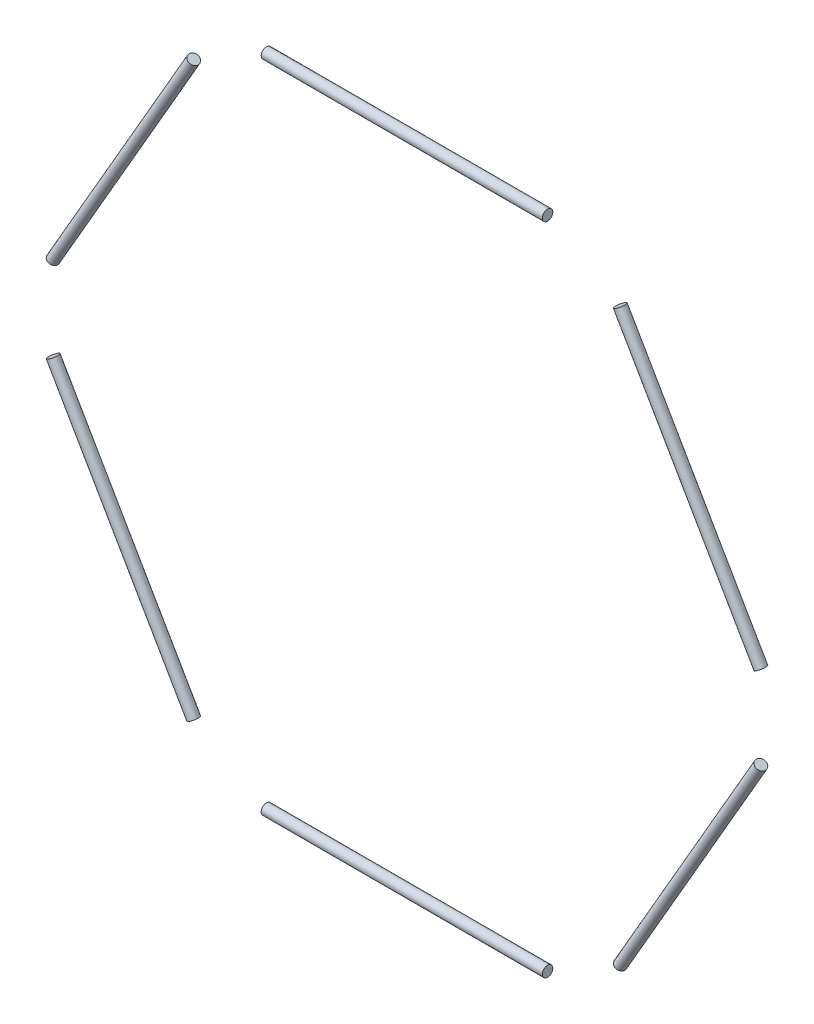
ISO-10303-21;
HEADER;
FILE_DESCRIPTION(('STEP AP214'),'2;1');
FILE_NAME('part.step','',(''),(''),'','','');
FILE_SCHEMA(('AUTOMOTIVE_DESIGN { 1 0 10303 214 1 1 1 1 }'));
ENDSEC;
DATA;
#1=APPLICATION_CONTEXT('core data for automotive mechanical design processes');
#2=APPLICATION_PROTOCOL_DEFINITION('international standard','automotive_design',2000,#1);
#3=PRODUCT_CONTEXT('',#1,'mechanical');
#4=PRODUCT('Part','Part','',(#3));
#5=PRODUCT_RELATED_PRODUCT_CATEGORY('part','',(#4));
#6=PRODUCT_DEFINITION_FORMATION('','',#4);
#7=PRODUCT_DEFINITION_CONTEXT('part definition',#1,'design');
#8=PRODUCT_DEFINITION('design','',#6,#7);
#9=PRODUCT_DEFINITION_SHAPE('','',#8);
#10=(LENGTH_UNIT() NAMED_UNIT(*) SI_UNIT(.MILLI.,.METRE.));
#11=(NAMED_UNIT(*) PLANE_ANGLE_UNIT() SI_UNIT($,.RADIAN.));
#12=(NAMED_UNIT(*) SI_UNIT($,.STERADIAN.) SOLID_ANGLE_UNIT());
#13=UNCERTAINTY_MEASURE_WITH_UNIT(LENGTH_MEASURE(1.E-05),#10,'distance_accuracy_value','');
#14=(GEOMETRIC_REPRESENTATION_CONTEXT(3) GLOBAL_UNCERTAINTY_ASSIGNED_CONTEXT((#13)) GLOBAL_UNIT_ASSIGNED_CONTEXT((#10,
#11,#12)) REPRESENTATION_CONTEXT('',''));
#15=CARTESIAN_POINT('',(0.,0.,0.));
#16=DIRECTION('',(0.,0.,1.));
#17=DIRECTION('',(1.,0.,0.));
#18=AXIS2_PLACEMENT_3D('',#15,#16,#17);
#19=CARTESIAN_POINT('',(36.6704064201291,49.0849929461358,0.));
#20=DIRECTION('',(-0.50000000000001,0.866025403784433,0.));
#21=DIRECTION('',(0.,0.,1.));
#22=AXIS2_PLACEMENT_3D('',#19,#20,#21);
#23=CYLINDRICAL_SURFACE('',#22,0.900000000000005);
#24=CARTESIAN_POINT('',(60.844054045998,7.21500705386527,0.));
#25=DIRECTION('',(-0.50000000000001,0.866025403784433,0.));
#26=DIRECTION('',(0.,0.,1.));
#27=AXIS2_PLACEMENT_3D('',#24,#25,#26);
#28=CIRCLE('',#27,0.900000000000005);
#29=CARTESIAN_POINT('',(60.844054045998,7.21500705386527,0.900000000000005));
#30=VERTEX_POINT('',#29);
#31=EDGE_CURVE('E48',#30,#30,#28,.T.);
#32=ORIENTED_EDGE('',*,*,#31,.T.);
#33=EDGE_LOOP('',(#32));
#34=FACE_BOUND('',#33,.T.);
#35=CARTESIAN_POINT('',(36.6704064201291,49.0849929461359,0.));
#36=DIRECTION('',(-0.50000000000001,0.866025403784433,0.));
#37=DIRECTION('',(0.,0.,1.));
#38=AXIS2_PLACEMENT_3D('',#35,#36,#37);
#39=CIRCLE('',#38,0.900000000000005);
#40=CARTESIAN_POINT('',(36.6704064201291,49.0849929461359,0.900000000000005));
#41=VERTEX_POINT('',#40);
#42=EDGE_CURVE('E11',#41,#41,#39,.T.);
#43=ORIENTED_EDGE('',*,*,#42,.F.);
#44=EDGE_LOOP('',(#43));
#45=FACE_BOUND('',#44,.T.);
#46=ADVANCED_FACE('F42',(#34,#45),#23,.T.);
#47=CARTESIAN_POINT('',(-12.0868238129345,20.9349929461353,0.));
#48=DIRECTION('',(0.50000000000001,-0.866025403784433,0.));
#49=DIRECTION('',(0.,0.,-1.));
#50=AXIS2_PLACEMENT_3D('',#47,#48,#49);
#51=PLANE('',#50);
#52=ORIENTED_EDGE('',*,*,#42,.T.);
#53=EDGE_LOOP('',(#52));
#54=FACE_BOUND('',#53,.T.);
#55=ADVANCED_FACE('F58',(#54),#51,.F.);
#56=CARTESIAN_POINT('',(12.0868238129345,-20.9349929461353,0.));
#57=DIRECTION('',(0.50000000000001,-0.866025403784433,0.));
#58=DIRECTION('',(0.,0.,-1.));
#59=AXIS2_PLACEMENT_3D('',#56,#57,#58);
#60=PLANE('',#59);
#61=ORIENTED_EDGE('',*,*,#31,.F.);
#62=EDGE_LOOP('',(#61));
#63=FACE_BOUND('',#62,.T.);
#64=ADVANCED_FACE('F56',(#63),#60,.T.);
#65=CLOSED_SHELL('',(#46,#55,#64));
#66=MANIFOLD_SOLID_BREP('B2',#65);
#67=CARTESIAN_POINT('',(60.8440540459982,-7.21500705386401,0.));
#68=DIRECTION('',(0.499999999999992,0.866025403784443,0.));
#69=DIRECTION('',(0.,0.,1.));
#70=AXIS2_PLACEMENT_3D('',#67,#68,#69);
#71=CYLINDRICAL_SURFACE('',#70,0.900000000000005);
#72=CARTESIAN_POINT('',(36.6704064201301,-49.0849929461351,0.));
#73=DIRECTION('',(0.499999999999992,0.866025403784443,0.));
#74=DIRECTION('',(0.,0.,1.));
#75=AXIS2_PLACEMENT_3D('',#72,#73,#74);
#76=CIRCLE('',#75,0.900000000000005);
#77=CARTESIAN_POINT('',(36.6704064201301,-49.0849929461351,0.900000000000005));
#78=VERTEX_POINT('',#77);
#79=EDGE_CURVE('E97',#78,#78,#76,.T.);
#80=ORIENTED_EDGE('',*,*,#79,.T.);
#81=EDGE_LOOP('',(#80));
#82=FACE_BOUND('',#81,.T.);
#83=CARTESIAN_POINT('',(60.8440540459982,-7.215007053864,0.));
#84=DIRECTION('',(0.499999999999992,0.866025403784443,0.));
#85=DIRECTION('',(0.,0.,1.));
#86=AXIS2_PLACEMENT_3D('',#83,#84,#85);
#87=CIRCLE('',#86,0.900000000000005);
#88=CARTESIAN_POINT('',(60.8440540459982,-7.215007053864,0.900000000000005));
#89=VERTEX_POINT('',#88);
#90=EDGE_CURVE('E41',#89,#89,#87,.T.);
#91=ORIENTED_EDGE('',*,*,#90,.F.);
#92=EDGE_LOOP('',(#91));
#93=FACE_BOUND('',#92,.T.);
#94=ADVANCED_FACE('F91',(#82,#93),#71,.T.);
#95=CARTESIAN_POINT('',(12.086823812934,20.9349929461355,0.));
#96=DIRECTION('',(-0.499999999999992,-0.866025403784443,0.));
#97=DIRECTION('',(0.,0.,-1.));
#98=AXIS2_PLACEMENT_3D('',#95,#96,#97);
#99=PLANE('',#98);
#100=ORIENTED_EDGE('',*,*,#90,.T.);
#101=EDGE_LOOP('',(#100));
#102=FACE_BOUND('',#101,.T.);
#103=ADVANCED_FACE('F107',(#102),#99,.F.);
#104=CARTESIAN_POINT('',(-12.086823812934,-20.9349929461355,0.));
#105=DIRECTION('',(-0.499999999999992,-0.866025403784443,0.));
#106=DIRECTION('',(0.,0.,-1.));
#107=AXIS2_PLACEMENT_3D('',#104,#105,#106);
#108=PLANE('',#107);
#109=ORIENTED_EDGE('',*,*,#79,.F.);
#110=EDGE_LOOP('',(#109));
#111=FACE_BOUND('',#110,.T.);
#112=ADVANCED_FACE('F105',(#111),#108,.T.);
#113=CLOSED_SHELL('',(#94,#103,#112));
#114=MANIFOLD_SOLID_BREP('B6',#113);
#115=CARTESIAN_POINT('',(24.1736476258684,-56.3,0.));
#116=DIRECTION('',(1.,0.,0.));
#117=DIRECTION('',(0.,0.,1.));
#118=AXIS2_PLACEMENT_3D('',#115,#116,#117);
#119=CYLINDRICAL_SURFACE('',#118,0.900000000000005);
#120=CARTESIAN_POINT('',(-24.1736476258684,-56.3,0.));
#121=DIRECTION('',(1.,0.,0.));
#122=DIRECTION('',(0.,0.,1.));
#123=AXIS2_PLACEMENT_3D('',#120,#121,#122);
#124=CIRCLE('',#123,0.900000000000005);
#125=CARTESIAN_POINT('',(-24.1736476258684,-56.3,0.900000000000005));
#126=VERTEX_POINT('',#125);
#127=EDGE_CURVE('E146',#126,#126,#124,.T.);
#128=ORIENTED_EDGE('',*,*,#127,.T.);
#129=EDGE_LOOP('',(#128));
#130=FACE_BOUND('',#129,.T.);
#131=CARTESIAN_POINT('',(24.1736476258684,-56.3,0.));
#132=DIRECTION('',(1.,0.,0.));
#133=DIRECTION('',(0.,0.,1.));
#134=AXIS2_PLACEMENT_3D('',#131,#132,#133);
#135=CIRCLE('',#134,0.900000000000005);
#136=CARTESIAN_POINT('',(24.1736476258684,-56.3,0.900000000000005));
#137=VERTEX_POINT('',#136);
#138=EDGE_CURVE('E90',#137,#137,#135,.T.);
#139=ORIENTED_EDGE('',*,*,#138,.F.);
#140=EDGE_LOOP('',(#139));
#141=FACE_BOUND('',#140,.T.);
#142=ADVANCED_FACE('F140',(#130,#141),#119,.T.);
#143=CARTESIAN_POINT('',(24.1736476258684,0.,0.));
#144=DIRECTION('',(-1.,0.,0.));
#145=DIRECTION('',(0.,0.,-1.));
#146=AXIS2_PLACEMENT_3D('',#143,#144,#145);
#147=PLANE('',#146);
#148=ORIENTED_EDGE('',*,*,#138,.T.);
#149=EDGE_LOOP('',(#148));
#150=FACE_BOUND('',#149,.T.);
#151=ADVANCED_FACE('F156',(#150),#147,.F.);
#152=CARTESIAN_POINT('',(-24.1736476258684,0.,0.));
#153=DIRECTION('',(-1.,0.,0.));
#154=DIRECTION('',(0.,0.,-1.));
#155=AXIS2_PLACEMENT_3D('',#152,#153,#154);
#156=PLANE('',#155);
#157=ORIENTED_EDGE('',*,*,#127,.F.);
#158=EDGE_LOOP('',(#157));
#159=FACE_BOUND('',#158,.T.);
#160=ADVANCED_FACE('F154',(#159),#156,.T.);
#161=CLOSED_SHELL('',(#142,#151,#160));
#162=MANIFOLD_SOLID_BREP('B36',#161);
#163=CARTESIAN_POINT('',(-36.6704064201295,-49.0849929461356,0.));
#164=DIRECTION('',(0.500000000000004,-0.866025403784436,0.));
#165=DIRECTION('',(0.,0.,1.));
#166=AXIS2_PLACEMENT_3D('',#163,#164,#165);
#167=CYLINDRICAL_SURFACE('',#166,0.900000000000005);
#168=CARTESIAN_POINT('',(-60.8440540459981,-7.21500705386485,0.));
#169=DIRECTION('',(0.500000000000004,-0.866025403784436,0.));
#170=DIRECTION('',(0.,0.,1.));
#171=AXIS2_PLACEMENT_3D('',#168,#169,#170);
#172=CIRCLE('',#171,0.900000000000005);
#173=CARTESIAN_POINT('',(-60.8440540459981,-7.21500705386485,0.900000000000005));
#174=VERTEX_POINT('',#173);
#175=EDGE_CURVE('E195',#174,#174,#172,.T.);
#176=ORIENTED_EDGE('',*,*,#175,.T.);
#177=EDGE_LOOP('',(#176));
#178=FACE_BOUND('',#177,.T.);
#179=CARTESIAN_POINT('',(-36.6704064201295,-49.0849929461356,0.));
#180=DIRECTION('',(0.500000000000004,-0.866025403784436,0.));
#181=DIRECTION('',(0.,0.,1.));
#182=AXIS2_PLACEMENT_3D('',#179,#180,#181);
#183=CIRCLE('',#182,0.900000000000005);
#184=CARTESIAN_POINT('',(-36.6704064201295,-49.0849929461356,0.900000000000005));
#185=VERTEX_POINT('',#184);
#186=EDGE_CURVE('E139',#185,#185,#183,.T.);
#187=ORIENTED_EDGE('',*,*,#186,.F.);
#188=EDGE_LOOP('',(#187));
#189=FACE_BOUND('',#188,.T.);
#190=ADVANCED_FACE('F189',(#178,#189),#167,.T.);
#191=CARTESIAN_POINT('',(12.0868238129343,-20.9349929461354,0.));
#192=DIRECTION('',(-0.500000000000004,0.866025403784436,0.));
#193=DIRECTION('',(0.,0.,-1.));
#194=AXIS2_PLACEMENT_3D('',#191,#192,#193);
#195=PLANE('',#194);
#196=ORIENTED_EDGE('',*,*,#186,.T.);
#197=EDGE_LOOP('',(#196));
#198=FACE_BOUND('',#197,.T.);
#199=ADVANCED_FACE('F205',(#198),#195,.F.);
#200=CARTESIAN_POINT('',(-12.0868238129343,20.9349929461354,0.));
#201=DIRECTION('',(-0.500000000000004,0.866025403784436,0.));
#202=DIRECTION('',(0.,0.,-1.));
#203=AXIS2_PLACEMENT_3D('',#200,#201,#202);
#204=PLANE('',#203);
#205=ORIENTED_EDGE('',*,*,#175,.F.);
#206=EDGE_LOOP('',(#205));
#207=FACE_BOUND('',#206,.T.);
#208=ADVANCED_FACE('F203',(#207),#204,.T.);
#209=CLOSED_SHELL('',(#190,#199,#208));
#210=MANIFOLD_SOLID_BREP('B85',#209);
#211=CARTESIAN_POINT('',(-60.8440540459981,7.21500705386443,0.));
#212=DIRECTION('',(-0.499999999999998,-0.86602540378444,0.));
#213=DIRECTION('',(0.,0.,1.));
#214=AXIS2_PLACEMENT_3D('',#211,#212,#213);
#215=CYLINDRICAL_SURFACE('',#214,0.900000000000005);
#216=CARTESIAN_POINT('',(-36.6704064201298,49.0849929461354,0.));
#217=DIRECTION('',(-0.499999999999998,-0.86602540378444,0.));
#218=DIRECTION('',(0.,0.,1.));
#219=AXIS2_PLACEMENT_3D('',#216,#217,#218);
#220=CIRCLE('',#219,0.900000000000005);
#221=CARTESIAN_POINT('',(-36.6704064201298,49.0849929461354,0.900000000000005));
#222=VERTEX_POINT('',#221);
#223=EDGE_CURVE('E243',#222,#222,#220,.T.);
#224=ORIENTED_EDGE('',*,*,#223,.T.);
#225=EDGE_LOOP('',(#224));
#226=FACE_BOUND('',#225,.T.);
#227=CARTESIAN_POINT('',(-60.8440540459981,7.21500705386442,0.));
#228=DIRECTION('',(-0.499999999999998,-0.86602540378444,0.));
#229=DIRECTION('',(0.,0.,1.));
#230=AXIS2_PLACEMENT_3D('',#227,#228,#229);
#231=CIRCLE('',#230,0.900000000000005);
#232=CARTESIAN_POINT('',(-60.8440540459981,7.21500705386442,0.900000000000005));
#233=VERTEX_POINT('',#232);
#234=EDGE_CURVE('E188',#233,#233,#231,.T.);
#235=ORIENTED_EDGE('',*,*,#234,.F.);
#236=EDGE_LOOP('',(#235));
#237=FACE_BOUND('',#236,.T.);
#238=ADVANCED_FACE('F237',(#226,#237),#215,.T.);
#239=CARTESIAN_POINT('',(-12.0868238129342,-20.9349929461355,0.));
#240=DIRECTION('',(0.499999999999998,0.86602540378444,0.));
#241=DIRECTION('',(0.,0.,-1.));
#242=AXIS2_PLACEMENT_3D('',#239,#240,#241);
#243=PLANE('',#242);
#244=ORIENTED_EDGE('',*,*,#234,.T.);
#245=EDGE_LOOP('',(#244));
#246=FACE_BOUND('',#245,.T.);
#247=ADVANCED_FACE('F253',(#246),#243,.F.);
#248=CARTESIAN_POINT('',(12.0868238129342,20.9349929461355,0.));
#249=DIRECTION('',(0.499999999999998,0.86602540378444,0.));
#250=DIRECTION('',(0.,0.,-1.));
#251=AXIS2_PLACEMENT_3D('',#248,#249,#250);
#252=PLANE('',#251);
#253=ORIENTED_EDGE('',*,*,#223,.F.);
#254=EDGE_LOOP('',(#253));
#255=FACE_BOUND('',#254,.T.);
#256=ADVANCED_FACE('F251',(#255),#252,.T.);
#257=CLOSED_SHELL('',(#238,#247,#256));
#258=MANIFOLD_SOLID_BREP('B134',#257);
#259=CARTESIAN_POINT('',(-24.1736476258684,56.3,0.));
#260=DIRECTION('',(-1.,0.,0.));
#261=DIRECTION('',(0.,0.,1.));
#262=AXIS2_PLACEMENT_3D('',#259,#260,#261);
#263=CYLINDRICAL_SURFACE('',#262,0.900000000000005);
#264=CARTESIAN_POINT('',(24.1736476258684,56.3,0.));
#265=DIRECTION('',(-1.,0.,0.));
#266=DIRECTION('',(0.,0.,1.));
#267=AXIS2_PLACEMENT_3D('',#264,#265,#266);
#268=CIRCLE('',#267,0.900000000000005);
#269=CARTESIAN_POINT('',(24.1736476258684,56.3,0.900000000000005));
#270=VERTEX_POINT('',#269);
#271=EDGE_CURVE('E284',#270,#270,#268,.T.);
#272=ORIENTED_EDGE('',*,*,#271,.T.);
#273=EDGE_LOOP('',(#272));
#274=FACE_BOUND('',#273,.T.);
#275=CARTESIAN_POINT('',(-24.1736476258684,56.3,0.));
#276=DIRECTION('',(-1.,0.,0.));
#277=DIRECTION('',(0.,0.,1.));
#278=AXIS2_PLACEMENT_3D('',#275,#276,#277);
#279=CIRCLE('',#278,0.900000000000005);
#280=CARTESIAN_POINT('',(-24.1736476258684,56.3,0.900000000000005));
#281=VERTEX_POINT('',#280);
#282=EDGE_CURVE('E236',#281,#281,#279,.T.);
#283=ORIENTED_EDGE('',*,*,#282,.F.);
#284=EDGE_LOOP('',(#283));
#285=FACE_BOUND('',#284,.T.);
#286=ADVANCED_FACE('F278',(#274,#285),#263,.T.);
#287=CARTESIAN_POINT('',(-24.1736476258684,0.,0.));
#288=DIRECTION('',(1.,0.,0.));
#289=DIRECTION('',(0.,0.,-1.));
#290=AXIS2_PLACEMENT_3D('',#287,#288,#289);
#291=PLANE('',#290);
#292=ORIENTED_EDGE('',*,*,#282,.T.);
#293=EDGE_LOOP('',(#292));
#294=FACE_BOUND('',#293,.T.);
#295=ADVANCED_FACE('F294',(#294),#291,.F.);
#296=CARTESIAN_POINT('',(24.1736476258684,0.,0.));
#297=DIRECTION('',(1.,0.,0.));
#298=DIRECTION('',(0.,0.,-1.));
#299=AXIS2_PLACEMENT_3D('',#296,#297,#298);
#300=PLANE('',#299);
#301=ORIENTED_EDGE('',*,*,#271,.F.);
#302=EDGE_LOOP('',(#301));
#303=FACE_BOUND('',#302,.T.);
#304=ADVANCED_FACE('F292',(#303),#300,.T.);
#305=CLOSED_SHELL('',(#286,#295,#304));
#306=MANIFOLD_SOLID_BREP('B183',#305);
#307=ADVANCED_BREP_SHAPE_REPRESENTATION('',(#18,#66,#114,#162,#210,#258,#306),#14);
#308=SHAPE_DEFINITION_REPRESENTATION(#9,#307);
ENDSEC;
END-ISO-10303-21;
